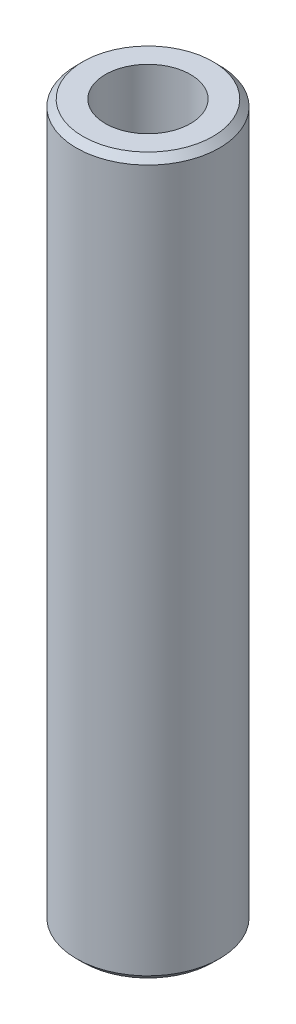
ISO-10303-21;
HEADER;
FILE_DESCRIPTION(('STEP AP214'),'2;1');
FILE_NAME('part.step','',(''),(''),'','','');
FILE_SCHEMA(('AUTOMOTIVE_DESIGN { 1 0 10303 214 1 1 1 1 }'));
ENDSEC;
DATA;
#1=APPLICATION_CONTEXT('core data for automotive mechanical design processes');
#2=APPLICATION_PROTOCOL_DEFINITION('international standard','automotive_design',2000,#1);
#3=PRODUCT_CONTEXT('',#1,'mechanical');
#4=PRODUCT('Part','Part','',(#3));
#5=PRODUCT_RELATED_PRODUCT_CATEGORY('part','',(#4));
#6=PRODUCT_DEFINITION_FORMATION('','',#4);
#7=PRODUCT_DEFINITION_CONTEXT('part definition',#1,'design');
#8=PRODUCT_DEFINITION('design','',#6,#7);
#9=PRODUCT_DEFINITION_SHAPE('','',#8);
#10=(LENGTH_UNIT() NAMED_UNIT(*) SI_UNIT(.MILLI.,.METRE.));
#11=(NAMED_UNIT(*) PLANE_ANGLE_UNIT() SI_UNIT($,.RADIAN.));
#12=(NAMED_UNIT(*) SI_UNIT($,.STERADIAN.) SOLID_ANGLE_UNIT());
#13=UNCERTAINTY_MEASURE_WITH_UNIT(LENGTH_MEASURE(1.E-05),#10,'distance_accuracy_value','');
#14=(GEOMETRIC_REPRESENTATION_CONTEXT(3) GLOBAL_UNCERTAINTY_ASSIGNED_CONTEXT((#13)) GLOBAL_UNIT_ASSIGNED_CONTEXT((#10,
#11,#12)) REPRESENTATION_CONTEXT('',''));
#15=CARTESIAN_POINT('',(0.,0.,0.));
#16=DIRECTION('',(0.,0.,1.));
#17=DIRECTION('',(1.,0.,0.));
#18=AXIS2_PLACEMENT_3D('',#15,#16,#17);
#19=CARTESIAN_POINT('',(0.,600.,0.));
#20=DIRECTION('',(0.,-1.,0.));
#21=DIRECTION('',(0.,0.,-1.));
#22=AXIS2_PLACEMENT_3D('',#19,#20,#21);
#23=CYLINDRICAL_SURFACE('',#22,60.);
#24=CARTESIAN_POINT('',(0.,594.415947742525,0.));
#25=DIRECTION('',(0.,1.,0.));
#26=DIRECTION('',(0.,0.,1.));
#27=AXIS2_PLACEMENT_3D('',#24,#25,#26);
#28=CIRCLE('',#27,60.);
#29=CARTESIAN_POINT('',(0.,594.415947742525,60.));
#30=VERTEX_POINT('',#29);
#31=EDGE_CURVE('E50',#30,#30,#28,.F.);
#32=ORIENTED_EDGE('',*,*,#31,.T.);
#33=EDGE_LOOP('',(#32));
#34=FACE_BOUND('',#33,.T.);
#35=CARTESIAN_POINT('',(0.,5.52731783734872,0.));
#36=DIRECTION('',(0.,1.,0.));
#37=DIRECTION('',(0.,0.,1.));
#38=AXIS2_PLACEMENT_3D('',#35,#36,#37);
#39=CIRCLE('',#38,60.);
#40=CARTESIAN_POINT('',(0.,5.52731783734872,60.));
#41=VERTEX_POINT('',#40);
#42=EDGE_CURVE('E51',#41,#41,#39,.T.);
#43=ORIENTED_EDGE('',*,*,#42,.T.);
#44=EDGE_LOOP('',(#43));
#45=FACE_BOUND('',#44,.T.);
#46=ADVANCED_FACE('F39',(#34,#45),#23,.T.);
#47=CARTESIAN_POINT('',(0.,600.,0.));
#48=DIRECTION('',(0.,1.,0.));
#49=DIRECTION('',(0.,0.,1.));
#50=AXIS2_PLACEMENT_3D('',#47,#48,#49);
#51=PLANE('',#50);
#52=CARTESIAN_POINT('',(0.,600.,0.));
#53=DIRECTION('',(0.,1.,0.));
#54=DIRECTION('',(0.,0.,1.));
#55=AXIS2_PLACEMENT_3D('',#52,#53,#54);
#56=CIRCLE('',#55,54.4726821626511);
#57=CARTESIAN_POINT('',(0.,600.,54.4726821626511));
#58=VERTEX_POINT('',#57);
#59=EDGE_CURVE('E54',#58,#58,#56,.T.);
#60=ORIENTED_EDGE('',*,*,#59,.T.);
#61=EDGE_LOOP('',(#60));
#62=FACE_BOUND('',#61,.T.);
#63=CARTESIAN_POINT('',(0.,600.,0.));
#64=DIRECTION('',(0.,1.,0.));
#65=DIRECTION('',(0.,0.,1.));
#66=AXIS2_PLACEMENT_3D('',#63,#64,#65);
#67=CIRCLE('',#66,35.6991519715155);
#68=CARTESIAN_POINT('',(0.,600.,35.6991519715155));
#69=VERTEX_POINT('',#68);
#70=EDGE_CURVE('E58',#69,#69,#67,.T.);
#71=ORIENTED_EDGE('',*,*,#70,.F.);
#72=EDGE_LOOP('',(#71));
#73=FACE_BOUND('',#72,.T.);
#74=ADVANCED_FACE('F69',(#62,#73),#51,.T.);
#75=CARTESIAN_POINT('',(0.,0.,0.));
#76=DIRECTION('',(0.,1.,0.));
#77=DIRECTION('',(0.,0.,1.));
#78=AXIS2_PLACEMENT_3D('',#75,#76,#77);
#79=PLANE('',#78);
#80=CARTESIAN_POINT('',(0.,0.,0.));
#81=DIRECTION('',(0.,1.,0.));
#82=DIRECTION('',(0.,0.,1.));
#83=AXIS2_PLACEMENT_3D('',#80,#81,#82);
#84=CIRCLE('',#83,54.4159477425256);
#85=CARTESIAN_POINT('',(0.,0.,54.4159477425256));
#86=VERTEX_POINT('',#85);
#87=EDGE_CURVE('E10',#86,#86,#84,.F.);
#88=ORIENTED_EDGE('',*,*,#87,.T.);
#89=EDGE_LOOP('',(#88));
#90=FACE_BOUND('',#89,.T.);
#91=CARTESIAN_POINT('',(0.,0.,0.));
#92=DIRECTION('',(0.,1.,0.));
#93=DIRECTION('',(0.,0.,1.));
#94=AXIS2_PLACEMENT_3D('',#91,#92,#93);
#95=CIRCLE('',#94,35.6991519715155);
#96=CARTESIAN_POINT('',(0.,0.,35.6991519715155));
#97=VERTEX_POINT('',#96);
#98=EDGE_CURVE('E63',#97,#97,#95,.T.);
#99=ORIENTED_EDGE('',*,*,#98,.T.);
#100=EDGE_LOOP('',(#99));
#101=FACE_BOUND('',#100,.T.);
#102=ADVANCED_FACE('F75',(#90,#101),#79,.F.);
#103=CARTESIAN_POINT('',(0.,600.,0.));
#104=DIRECTION('',(0.,-1.,0.));
#105=DIRECTION('',(0.,0.,-1.));
#106=AXIS2_PLACEMENT_3D('',#103,#104,#105);
#107=CYLINDRICAL_SURFACE('',#106,35.6991519715155);
#108=ORIENTED_EDGE('',*,*,#70,.T.);
#109=EDGE_LOOP('',(#108));
#110=FACE_BOUND('',#109,.T.);
#111=ORIENTED_EDGE('',*,*,#98,.F.);
#112=EDGE_LOOP('',(#111));
#113=FACE_BOUND('',#112,.T.);
#114=ADVANCED_FACE('F70',(#110,#113),#107,.F.);
#115=CARTESIAN_POINT('',(0.,600.,0.));
#116=DIRECTION('',(0.,-1.,0.));
#117=DIRECTION('',(0.,0.,-1.));
#118=AXIS2_PLACEMENT_3D('',#115,#116,#117);
#119=CONICAL_SURFACE('',#118,54.4726821626511,0.780292228971017);
#120=ORIENTED_EDGE('',*,*,#31,.F.);
#121=EDGE_LOOP('',(#120));
#122=FACE_BOUND('',#121,.T.);
#123=ORIENTED_EDGE('',*,*,#59,.F.);
#124=EDGE_LOOP('',(#123));
#125=FACE_BOUND('',#124,.T.);
#126=ADVANCED_FACE('F81',(#122,#125),#119,.T.);
#127=CARTESIAN_POINT('',(0.,5.52731783734872,0.));
#128=DIRECTION('',(0.,1.,0.));
#129=DIRECTION('',(0.,0.,1.));
#130=AXIS2_PLACEMENT_3D('',#127,#128,#129);
#131=CONICAL_SURFACE('',#130,60.,0.790504097823885);
#132=ORIENTED_EDGE('',*,*,#87,.F.);
#133=EDGE_LOOP('',(#132));
#134=FACE_BOUND('',#133,.T.);
#135=ORIENTED_EDGE('',*,*,#42,.F.);
#136=EDGE_LOOP('',(#135));
#137=FACE_BOUND('',#136,.T.);
#138=ADVANCED_FACE('F45',(#134,#137),#131,.T.);
#139=CLOSED_SHELL('',(#46,#74,#102,#114,#126,#138));
#140=MANIFOLD_SOLID_BREP('B2',#139);
#141=ADVANCED_BREP_SHAPE_REPRESENTATION('',(#18,#140),#14);
#142=SHAPE_DEFINITION_REPRESENTATION(#9,#141);
ENDSEC;
END-ISO-10303-21;
